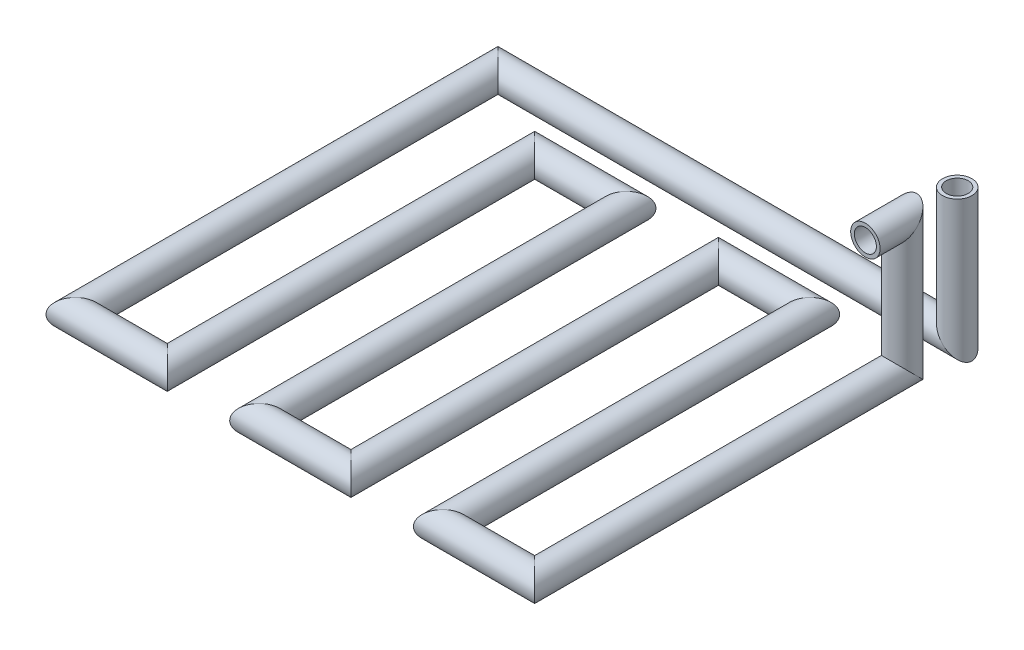
ISO-10303-21;
HEADER;
FILE_DESCRIPTION(('STEP AP214'),'2;1');
FILE_NAME('part.step','',(''),(''),'','','');
FILE_SCHEMA(('AUTOMOTIVE_DESIGN { 1 0 10303 214 1 1 1 1 }'));
ENDSEC;
DATA;
#1=APPLICATION_CONTEXT('core data for automotive mechanical design processes');
#2=APPLICATION_PROTOCOL_DEFINITION('international standard','automotive_design',2000,#1);
#3=PRODUCT_CONTEXT('',#1,'mechanical');
#4=PRODUCT('Part','Part','',(#3));
#5=PRODUCT_RELATED_PRODUCT_CATEGORY('part','',(#4));
#6=PRODUCT_DEFINITION_FORMATION('','',#4);
#7=PRODUCT_DEFINITION_CONTEXT('part definition',#1,'design');
#8=PRODUCT_DEFINITION('design','',#6,#7);
#9=PRODUCT_DEFINITION_SHAPE('','',#8);
#10=(LENGTH_UNIT() NAMED_UNIT(*) SI_UNIT(.MILLI.,.METRE.));
#11=(NAMED_UNIT(*) PLANE_ANGLE_UNIT() SI_UNIT($,.RADIAN.));
#12=(NAMED_UNIT(*) SI_UNIT($,.STERADIAN.) SOLID_ANGLE_UNIT());
#13=UNCERTAINTY_MEASURE_WITH_UNIT(LENGTH_MEASURE(1.E-05),#10,'distance_accuracy_value','');
#14=(GEOMETRIC_REPRESENTATION_CONTEXT(3) GLOBAL_UNCERTAINTY_ASSIGNED_CONTEXT((#13)) GLOBAL_UNIT_ASSIGNED_CONTEXT((#10,
#11,#12)) REPRESENTATION_CONTEXT('',''));
#15=CARTESIAN_POINT('',(0.,0.,0.));
#16=DIRECTION('',(0.,0.,1.));
#17=DIRECTION('',(1.,0.,0.));
#18=AXIS2_PLACEMENT_3D('',#15,#16,#17);
#19=CARTESIAN_POINT('',(0.,0.,-24.9999999999999));
#20=DIRECTION('',(0.,-1.,0.));
#21=DIRECTION('',(0.,0.,-1.));
#22=AXIS2_PLACEMENT_3D('',#19,#20,#21);
#23=PLANE('',#22);
#24=CARTESIAN_POINT('',(0.,0.,-24.9999999999999));
#25=DIRECTION('',(0.,-1.,0.));
#26=DIRECTION('',(0.,0.,-1.));
#27=AXIS2_PLACEMENT_3D('',#24,#25,#26);
#28=CIRCLE('',#27,3.);
#29=CARTESIAN_POINT('',(0.,0.,-27.9999999999999));
#30=VERTEX_POINT('',#29);
#31=EDGE_CURVE('E101',#30,#30,#28,.T.);
#32=ORIENTED_EDGE('',*,*,#31,.T.);
#33=EDGE_LOOP('',(#32));
#34=FACE_BOUND('',#33,.T.);
#35=CARTESIAN_POINT('',(0.,0.,-24.9999999999999));
#36=DIRECTION('',(0.,-1.,0.));
#37=DIRECTION('',(0.,0.,-1.));
#38=AXIS2_PLACEMENT_3D('',#35,#36,#37);
#39=CIRCLE('',#38,4.);
#40=CARTESIAN_POINT('',(0.,0.,-28.9999999999999));
#41=VERTEX_POINT('',#40);
#42=EDGE_CURVE('E45',#41,#41,#39,.T.);
#43=ORIENTED_EDGE('',*,*,#42,.F.);
#44=EDGE_LOOP('',(#43));
#45=FACE_BOUND('',#44,.T.);
#46=ADVANCED_FACE('F30',(#34,#45),#23,.F.);
#47=CARTESIAN_POINT('',(0.,0.,0.));
#48=DIRECTION('',(0.,0.,1.));
#49=DIRECTION('',(1.,0.,0.));
#50=AXIS2_PLACEMENT_3D('',#47,#48,#49);
#51=PLANE('',#50);
#52=CARTESIAN_POINT('',(0.,0.,0.));
#53=DIRECTION('',(0.,0.,1.));
#54=DIRECTION('',(1.,0.,0.));
#55=AXIS2_PLACEMENT_3D('',#52,#53,#54);
#56=CIRCLE('',#55,3.);
#57=CARTESIAN_POINT('',(3.,0.,0.));
#58=VERTEX_POINT('',#57);
#59=EDGE_CURVE('E55',#58,#58,#56,.T.);
#60=ORIENTED_EDGE('',*,*,#59,.F.);
#61=EDGE_LOOP('',(#60));
#62=FACE_BOUND('',#61,.T.);
#63=CARTESIAN_POINT('',(0.,0.,0.));
#64=DIRECTION('',(0.,0.,1.));
#65=DIRECTION('',(1.,0.,0.));
#66=AXIS2_PLACEMENT_3D('',#63,#64,#65);
#67=CIRCLE('',#66,4.);
#68=CARTESIAN_POINT('',(4.,0.,0.));
#69=VERTEX_POINT('',#68);
#70=EDGE_CURVE('E34',#69,#69,#67,.T.);
#71=ORIENTED_EDGE('',*,*,#70,.T.);
#72=EDGE_LOOP('',(#71));
#73=FACE_BOUND('',#72,.T.);
#74=ADVANCED_FACE('F198',(#62,#73),#51,.T.);
#75=CARTESIAN_POINT('',(0.,-41.7,-24.9999999999999));
#76=DIRECTION('',(0.,1.,0.));
#77=DIRECTION('',(0.,0.,1.));
#78=AXIS2_PLACEMENT_3D('',#75,#76,#77);
#79=CYLINDRICAL_SURFACE('',#78,4.);
#80=CARTESIAN_POINT('',(0.,-35.,-24.9999999999999));
#81=DIRECTION('',(0.707106781186547,0.707106781186547,0.));
#82=DIRECTION('',(0.707106781186547,-0.707106781186547,0.));
#83=AXIS2_PLACEMENT_3D('',#80,#81,#82);
#84=ELLIPSE('',#83,5.65685424949238,4.);
#85=CARTESIAN_POINT('',(3.99999999999997,-39.,-24.9999999999999));
#86=VERTEX_POINT('',#85);
#87=EDGE_CURVE('E47',#86,#86,#84,.T.);
#88=ORIENTED_EDGE('',*,*,#87,.T.);
#89=EDGE_LOOP('',(#88));
#90=FACE_BOUND('',#89,.T.);
#91=ORIENTED_EDGE('',*,*,#42,.T.);
#92=EDGE_LOOP('',(#91));
#93=FACE_BOUND('',#92,.T.);
#94=ADVANCED_FACE('F194',(#90,#93),#79,.T.);
#95=CARTESIAN_POINT('',(-128.4,-35.,-24.9999999999999));
#96=DIRECTION('',(1.,0.,0.));
#97=DIRECTION('',(0.,1.,0.));
#98=AXIS2_PLACEMENT_3D('',#95,#96,#97);
#99=CYLINDRICAL_SURFACE('',#98,4.);
#100=CARTESIAN_POINT('',(-125.,-35.,-24.9999999999999));
#101=DIRECTION('',(0.707106781186547,0.,-0.707106781186547));
#102=DIRECTION('',(-0.707106781186547,0.,-0.707106781186547));
#103=AXIS2_PLACEMENT_3D('',#100,#101,#102);
#104=ELLIPSE('',#103,5.65685424949238,4.);
#105=CARTESIAN_POINT('',(-129.,-35.,-28.9999999999999));
#106=VERTEX_POINT('',#105);
#107=EDGE_CURVE('E52',#106,#106,#104,.T.);
#108=ORIENTED_EDGE('',*,*,#107,.T.);
#109=EDGE_LOOP('',(#108));
#110=FACE_BOUND('',#109,.T.);
#111=ORIENTED_EDGE('',*,*,#87,.F.);
#112=EDGE_LOOP('',(#111));
#113=FACE_BOUND('',#112,.T.);
#114=ADVANCED_FACE('F190',(#110,#113),#99,.T.);
#115=CARTESIAN_POINT('',(-125.,-35.,93.4));
#116=DIRECTION('',(0.,0.,-1.));
#117=DIRECTION('',(0.,1.,0.));
#118=AXIS2_PLACEMENT_3D('',#115,#116,#117);
#119=CYLINDRICAL_SURFACE('',#118,4.);
#120=CARTESIAN_POINT('',(-125.,-35.,90.));
#121=DIRECTION('',(-0.707106781186548,0.,-0.707106781186547));
#122=DIRECTION('',(-0.707106781186548,0.,0.707106781186547));
#123=AXIS2_PLACEMENT_3D('',#120,#121,#122);
#124=ELLIPSE('',#123,5.65685424949238,4.);
#125=CARTESIAN_POINT('',(-129.,-35.,94.));
#126=VERTEX_POINT('',#125);
#127=EDGE_CURVE('E106',#126,#126,#124,.T.);
#128=ORIENTED_EDGE('',*,*,#127,.T.);
#129=EDGE_LOOP('',(#128));
#130=FACE_BOUND('',#129,.T.);
#131=ORIENTED_EDGE('',*,*,#107,.F.);
#132=EDGE_LOOP('',(#131));
#133=FACE_BOUND('',#132,.T.);
#134=ADVANCED_FACE('F186',(#130,#133),#119,.T.);
#135=CARTESIAN_POINT('',(-96.6000000000001,-35.,90.));
#136=DIRECTION('',(-1.,0.,0.));
#137=DIRECTION('',(0.,-1.,0.));
#138=AXIS2_PLACEMENT_3D('',#135,#136,#137);
#139=CYLINDRICAL_SURFACE('',#138,4.);
#140=CARTESIAN_POINT('',(-100.,-35.,90.));
#141=DIRECTION('',(-0.707106781186547,0.,0.707106781186547));
#142=DIRECTION('',(0.707106781186547,0.,0.707106781186547));
#143=AXIS2_PLACEMENT_3D('',#140,#141,#142);
#144=ELLIPSE('',#143,5.65685424949238,4.);
#145=CARTESIAN_POINT('',(-96.,-35.,94.));
#146=VERTEX_POINT('',#145);
#147=EDGE_CURVE('E109',#146,#146,#144,.T.);
#148=ORIENTED_EDGE('',*,*,#147,.T.);
#149=EDGE_LOOP('',(#148));
#150=FACE_BOUND('',#149,.T.);
#151=ORIENTED_EDGE('',*,*,#127,.F.);
#152=EDGE_LOOP('',(#151));
#153=FACE_BOUND('',#152,.T.);
#154=ADVANCED_FACE('F182',(#150,#153),#139,.T.);
#155=CARTESIAN_POINT('',(-100.,-35.,-13.4000000000001));
#156=DIRECTION('',(0.,0.,1.));
#157=DIRECTION('',(0.,-1.,0.));
#158=AXIS2_PLACEMENT_3D('',#155,#156,#157);
#159=CYLINDRICAL_SURFACE('',#158,4.);
#160=CARTESIAN_POINT('',(-100.,-35.,-10.));
#161=DIRECTION('',(-0.707106781186547,0.,0.707106781186548));
#162=DIRECTION('',(-0.707106781186548,0.,-0.707106781186547));
#163=AXIS2_PLACEMENT_3D('',#160,#161,#162);
#164=ELLIPSE('',#163,5.65685424949238,4.);
#165=CARTESIAN_POINT('',(-104.,-35.,-14.));
#166=VERTEX_POINT('',#165);
#167=EDGE_CURVE('E112',#166,#166,#164,.T.);
#168=ORIENTED_EDGE('',*,*,#167,.T.);
#169=EDGE_LOOP('',(#168));
#170=FACE_BOUND('',#169,.T.);
#171=ORIENTED_EDGE('',*,*,#147,.F.);
#172=EDGE_LOOP('',(#171));
#173=FACE_BOUND('',#172,.T.);
#174=ADVANCED_FACE('F178',(#170,#173),#159,.T.);
#175=CARTESIAN_POINT('',(-71.6,-35.,-10.));
#176=DIRECTION('',(-1.,0.,0.));
#177=DIRECTION('',(0.,-1.,0.));
#178=AXIS2_PLACEMENT_3D('',#175,#176,#177);
#179=CYLINDRICAL_SURFACE('',#178,4.);
#180=CARTESIAN_POINT('',(-75.,-35.,-10.));
#181=DIRECTION('',(-0.707106781186548,0.,-0.707106781186547));
#182=DIRECTION('',(0.707106781186547,0.,-0.707106781186548));
#183=AXIS2_PLACEMENT_3D('',#180,#181,#182);
#184=ELLIPSE('',#183,5.65685424949238,4.);
#185=CARTESIAN_POINT('',(-71.,-35.,-14.));
#186=VERTEX_POINT('',#185);
#187=EDGE_CURVE('E115',#186,#186,#184,.T.);
#188=ORIENTED_EDGE('',*,*,#187,.T.);
#189=EDGE_LOOP('',(#188));
#190=FACE_BOUND('',#189,.T.);
#191=ORIENTED_EDGE('',*,*,#167,.F.);
#192=EDGE_LOOP('',(#191));
#193=FACE_BOUND('',#192,.T.);
#194=ADVANCED_FACE('F174',(#190,#193),#179,.T.);
#195=CARTESIAN_POINT('',(-75.,-35.,93.4));
#196=DIRECTION('',(0.,0.,-1.));
#197=DIRECTION('',(0.,1.,0.));
#198=AXIS2_PLACEMENT_3D('',#195,#196,#197);
#199=CYLINDRICAL_SURFACE('',#198,4.);
#200=CARTESIAN_POINT('',(-75.,-35.,90.));
#201=DIRECTION('',(-0.707106781186547,0.,-0.707106781186547));
#202=DIRECTION('',(-0.707106781186547,0.,0.707106781186547));
#203=AXIS2_PLACEMENT_3D('',#200,#201,#202);
#204=ELLIPSE('',#203,5.65685424949238,4.);
#205=CARTESIAN_POINT('',(-79.,-35.,94.));
#206=VERTEX_POINT('',#205);
#207=EDGE_CURVE('E118',#206,#206,#204,.T.);
#208=ORIENTED_EDGE('',*,*,#207,.T.);
#209=EDGE_LOOP('',(#208));
#210=FACE_BOUND('',#209,.T.);
#211=ORIENTED_EDGE('',*,*,#187,.F.);
#212=EDGE_LOOP('',(#211));
#213=FACE_BOUND('',#212,.T.);
#214=ADVANCED_FACE('F170',(#210,#213),#199,.T.);
#215=CARTESIAN_POINT('',(-46.6,-35.,90.));
#216=DIRECTION('',(-1.,0.,0.));
#217=DIRECTION('',(0.,-1.,0.));
#218=AXIS2_PLACEMENT_3D('',#215,#216,#217);
#219=CYLINDRICAL_SURFACE('',#218,4.);
#220=CARTESIAN_POINT('',(-50.,-35.,90.));
#221=DIRECTION('',(-0.707106781186548,0.,0.707106781186547));
#222=DIRECTION('',(0.707106781186548,0.,0.707106781186547));
#223=AXIS2_PLACEMENT_3D('',#220,#221,#222);
#224=ELLIPSE('',#223,5.65685424949238,4.);
#225=CARTESIAN_POINT('',(-46.,-35.,94.));
#226=VERTEX_POINT('',#225);
#227=EDGE_CURVE('E121',#226,#226,#224,.T.);
#228=ORIENTED_EDGE('',*,*,#227,.T.);
#229=EDGE_LOOP('',(#228));
#230=FACE_BOUND('',#229,.T.);
#231=ORIENTED_EDGE('',*,*,#207,.F.);
#232=EDGE_LOOP('',(#231));
#233=FACE_BOUND('',#232,.T.);
#234=ADVANCED_FACE('F166',(#230,#233),#219,.T.);
#235=CARTESIAN_POINT('',(-50.,-35.,-13.4));
#236=DIRECTION('',(0.,0.,1.));
#237=DIRECTION('',(0.,-1.,0.));
#238=AXIS2_PLACEMENT_3D('',#235,#236,#237);
#239=CYLINDRICAL_SURFACE('',#238,4.);
#240=CARTESIAN_POINT('',(-50.,-35.,-10.));
#241=DIRECTION('',(-0.707106781186548,0.,0.707106781186547));
#242=DIRECTION('',(-0.707106781186548,0.,-0.707106781186547));
#243=AXIS2_PLACEMENT_3D('',#240,#241,#242);
#244=ELLIPSE('',#243,5.65685424949238,4.);
#245=CARTESIAN_POINT('',(-54.,-35.,-14.));
#246=VERTEX_POINT('',#245);
#247=EDGE_CURVE('E124',#246,#246,#244,.T.);
#248=ORIENTED_EDGE('',*,*,#247,.T.);
#249=EDGE_LOOP('',(#248));
#250=FACE_BOUND('',#249,.T.);
#251=ORIENTED_EDGE('',*,*,#227,.F.);
#252=EDGE_LOOP('',(#251));
#253=FACE_BOUND('',#252,.T.);
#254=ADVANCED_FACE('F162',(#250,#253),#239,.T.);
#255=CARTESIAN_POINT('',(-21.6,-35.,-10.));
#256=DIRECTION('',(-1.,0.,0.));
#257=DIRECTION('',(0.,-1.,0.));
#258=AXIS2_PLACEMENT_3D('',#255,#256,#257);
#259=CYLINDRICAL_SURFACE('',#258,4.);
#260=CARTESIAN_POINT('',(-25.,-35.,-10.));
#261=DIRECTION('',(-0.707106781186547,0.,-0.707106781186547));
#262=DIRECTION('',(0.707106781186547,0.,-0.707106781186547));
#263=AXIS2_PLACEMENT_3D('',#260,#261,#262);
#264=ELLIPSE('',#263,5.65685424949238,4.);
#265=CARTESIAN_POINT('',(-21.,-35.,-14.));
#266=VERTEX_POINT('',#265);
#267=EDGE_CURVE('E127',#266,#266,#264,.T.);
#268=ORIENTED_EDGE('',*,*,#267,.T.);
#269=EDGE_LOOP('',(#268));
#270=FACE_BOUND('',#269,.T.);
#271=ORIENTED_EDGE('',*,*,#247,.F.);
#272=EDGE_LOOP('',(#271));
#273=FACE_BOUND('',#272,.T.);
#274=ADVANCED_FACE('F158',(#270,#273),#259,.T.);
#275=CARTESIAN_POINT('',(-25.,-35.,93.4));
#276=DIRECTION('',(0.,0.,-1.));
#277=DIRECTION('',(0.,1.,0.));
#278=AXIS2_PLACEMENT_3D('',#275,#276,#277);
#279=CYLINDRICAL_SURFACE('',#278,4.);
#280=CARTESIAN_POINT('',(-25.,-35.,90.));
#281=DIRECTION('',(-0.707106781186547,0.,-0.707106781186548));
#282=DIRECTION('',(-0.707106781186547,0.,0.707106781186548));
#283=AXIS2_PLACEMENT_3D('',#280,#281,#282);
#284=ELLIPSE('',#283,5.65685424949238,4.);
#285=CARTESIAN_POINT('',(-29.,-35.,94.));
#286=VERTEX_POINT('',#285);
#287=EDGE_CURVE('E130',#286,#286,#284,.T.);
#288=ORIENTED_EDGE('',*,*,#287,.T.);
#289=EDGE_LOOP('',(#288));
#290=FACE_BOUND('',#289,.T.);
#291=ORIENTED_EDGE('',*,*,#267,.F.);
#292=EDGE_LOOP('',(#291));
#293=FACE_BOUND('',#292,.T.);
#294=ADVANCED_FACE('F155',(#290,#293),#279,.T.);
#295=CARTESIAN_POINT('',(3.39999999999999,-35.,90.));
#296=DIRECTION('',(-1.,0.,0.));
#297=DIRECTION('',(0.,0.,1.));
#298=AXIS2_PLACEMENT_3D('',#295,#296,#297);
#299=CYLINDRICAL_SURFACE('',#298,4.);
#300=CARTESIAN_POINT('',(0.,-35.,90.));
#301=DIRECTION('',(-0.707106781186547,0.,0.707106781186548));
#302=DIRECTION('',(0.707106781186547,0.,0.707106781186548));
#303=AXIS2_PLACEMENT_3D('',#300,#301,#302);
#304=ELLIPSE('',#303,5.65685424949238,4.);
#305=CARTESIAN_POINT('',(4.,-35.,94.));
#306=VERTEX_POINT('',#305);
#307=EDGE_CURVE('E132',#306,#306,#304,.T.);
#308=ORIENTED_EDGE('',*,*,#307,.T.);
#309=EDGE_LOOP('',(#308));
#310=FACE_BOUND('',#309,.T.);
#311=ORIENTED_EDGE('',*,*,#287,.F.);
#312=EDGE_LOOP('',(#311));
#313=FACE_BOUND('',#312,.T.);
#314=ADVANCED_FACE('F150',(#310,#313),#299,.T.);
#315=CARTESIAN_POINT('',(0.,-35.,-16.7));
#316=DIRECTION('',(0.,0.,1.));
#317=DIRECTION('',(1.,0.,0.));
#318=AXIS2_PLACEMENT_3D('',#315,#316,#317);
#319=CYLINDRICAL_SURFACE('',#318,4.);
#320=CARTESIAN_POINT('',(0.,-35.,-10.));
#321=DIRECTION('',(0.,-0.707106781186547,0.707106781186547));
#322=DIRECTION('',(0.,-0.707106781186547,-0.707106781186547));
#323=AXIS2_PLACEMENT_3D('',#320,#321,#322);
#324=ELLIPSE('',#323,5.65685424949238,4.);
#325=CARTESIAN_POINT('',(0.,-39.,-14.));
#326=VERTEX_POINT('',#325);
#327=EDGE_CURVE('E42',#326,#326,#324,.T.);
#328=ORIENTED_EDGE('',*,*,#327,.T.);
#329=EDGE_LOOP('',(#328));
#330=FACE_BOUND('',#329,.T.);
#331=ORIENTED_EDGE('',*,*,#307,.F.);
#332=EDGE_LOOP('',(#331));
#333=FACE_BOUND('',#332,.T.);
#334=ADVANCED_FACE('F139',(#330,#333),#319,.T.);
#335=CARTESIAN_POINT('',(0.,6.7,-10.));
#336=DIRECTION('',(0.,-1.,0.));
#337=DIRECTION('',(0.,0.,-1.));
#338=AXIS2_PLACEMENT_3D('',#335,#336,#337);
#339=CYLINDRICAL_SURFACE('',#338,4.);
#340=CARTESIAN_POINT('',(0.,0.,-10.));
#341=DIRECTION('',(0.,-0.707106781186547,-0.707106781186547));
#342=DIRECTION('',(0.,0.707106781186547,-0.707106781186547));
#343=AXIS2_PLACEMENT_3D('',#340,#341,#342);
#344=ELLIPSE('',#343,5.65685424949238,4.);
#345=CARTESIAN_POINT('',(0.,4.,-14.));
#346=VERTEX_POINT('',#345);
#347=EDGE_CURVE('E10',#346,#346,#344,.T.);
#348=ORIENTED_EDGE('',*,*,#347,.T.);
#349=EDGE_LOOP('',(#348));
#350=FACE_BOUND('',#349,.T.);
#351=ORIENTED_EDGE('',*,*,#327,.F.);
#352=EDGE_LOOP('',(#351));
#353=FACE_BOUND('',#352,.T.);
#354=ADVANCED_FACE('F142',(#350,#353),#339,.T.);
#355=CARTESIAN_POINT('',(0.,0.,0.));
#356=DIRECTION('',(0.,0.,-1.));
#357=DIRECTION('',(-1.,0.,0.));
#358=AXIS2_PLACEMENT_3D('',#355,#356,#357);
#359=CYLINDRICAL_SURFACE('',#358,4.);
#360=ORIENTED_EDGE('',*,*,#70,.F.);
#361=EDGE_LOOP('',(#360));
#362=FACE_BOUND('',#361,.T.);
#363=ORIENTED_EDGE('',*,*,#347,.F.);
#364=EDGE_LOOP('',(#363));
#365=FACE_BOUND('',#364,.T.);
#366=ADVANCED_FACE('F32',(#362,#365),#359,.T.);
#367=CARTESIAN_POINT('',(0.,-41.7,-24.9999999999999));
#368=DIRECTION('',(0.,1.,0.));
#369=DIRECTION('',(0.,0.,1.));
#370=AXIS2_PLACEMENT_3D('',#367,#368,#369);
#371=CYLINDRICAL_SURFACE('',#370,3.);
#372=CARTESIAN_POINT('',(0.,-35.,-24.9999999999999));
#373=DIRECTION('',(0.707106781186547,0.707106781186547,0.));
#374=DIRECTION('',(0.707106781186548,-0.707106781186548,0.));
#375=AXIS2_PLACEMENT_3D('',#372,#373,#374);
#376=ELLIPSE('',#375,4.24264068711929,3.);
#377=CARTESIAN_POINT('',(2.99999999999995,-38.,-24.9999999999999));
#378=VERTEX_POINT('',#377);
#379=EDGE_CURVE('E98',#378,#378,#376,.T.);
#380=ORIENTED_EDGE('',*,*,#379,.F.);
#381=EDGE_LOOP('',(#380));
#382=FACE_BOUND('',#381,.T.);
#383=ORIENTED_EDGE('',*,*,#31,.F.);
#384=EDGE_LOOP('',(#383));
#385=FACE_BOUND('',#384,.T.);
#386=ADVANCED_FACE('F148',(#382,#385),#371,.F.);
#387=CARTESIAN_POINT('',(-128.4,-35.,-24.9999999999999));
#388=DIRECTION('',(1.,0.,0.));
#389=DIRECTION('',(0.,1.,0.));
#390=AXIS2_PLACEMENT_3D('',#387,#388,#389);
#391=CYLINDRICAL_SURFACE('',#390,3.);
#392=CARTESIAN_POINT('',(-125.,-35.,-24.9999999999999));
#393=DIRECTION('',(0.707106781186548,0.,-0.707106781186548));
#394=DIRECTION('',(-0.707106781186548,0.,-0.707106781186548));
#395=AXIS2_PLACEMENT_3D('',#392,#393,#394);
#396=ELLIPSE('',#395,4.24264068711929,3.);
#397=CARTESIAN_POINT('',(-128.,-35.,-27.9999999999999));
#398=VERTEX_POINT('',#397);
#399=EDGE_CURVE('E95',#398,#398,#396,.T.);
#400=ORIENTED_EDGE('',*,*,#399,.F.);
#401=EDGE_LOOP('',(#400));
#402=FACE_BOUND('',#401,.T.);
#403=ORIENTED_EDGE('',*,*,#379,.T.);
#404=EDGE_LOOP('',(#403));
#405=FACE_BOUND('',#404,.T.);
#406=ADVANCED_FACE('F209',(#402,#405),#391,.F.);
#407=CARTESIAN_POINT('',(-125.,-35.,93.4));
#408=DIRECTION('',(0.,0.,-1.));
#409=DIRECTION('',(0.,1.,0.));
#410=AXIS2_PLACEMENT_3D('',#407,#408,#409);
#411=CYLINDRICAL_SURFACE('',#410,3.);
#412=CARTESIAN_POINT('',(-125.,-35.,90.));
#413=DIRECTION('',(-0.707106781186548,0.,-0.707106781186548));
#414=DIRECTION('',(-0.707106781186548,0.,0.707106781186548));
#415=AXIS2_PLACEMENT_3D('',#412,#413,#414);
#416=ELLIPSE('',#415,4.24264068711929,3.);
#417=CARTESIAN_POINT('',(-128.,-35.,93.));
#418=VERTEX_POINT('',#417);
#419=EDGE_CURVE('E92',#418,#418,#416,.T.);
#420=ORIENTED_EDGE('',*,*,#419,.F.);
#421=EDGE_LOOP('',(#420));
#422=FACE_BOUND('',#421,.T.);
#423=ORIENTED_EDGE('',*,*,#399,.T.);
#424=EDGE_LOOP('',(#423));
#425=FACE_BOUND('',#424,.T.);
#426=ADVANCED_FACE('F213',(#422,#425),#411,.F.);
#427=CARTESIAN_POINT('',(-96.6000000000001,-35.,90.));
#428=DIRECTION('',(-1.,0.,0.));
#429=DIRECTION('',(0.,-1.,0.));
#430=AXIS2_PLACEMENT_3D('',#427,#428,#429);
#431=CYLINDRICAL_SURFACE('',#430,3.);
#432=CARTESIAN_POINT('',(-100.,-35.,90.));
#433=DIRECTION('',(-0.707106781186547,0.,0.707106781186547));
#434=DIRECTION('',(0.707106781186548,0.,0.707106781186548));
#435=AXIS2_PLACEMENT_3D('',#432,#433,#434);
#436=ELLIPSE('',#435,4.24264068711929,3.);
#437=CARTESIAN_POINT('',(-97.,-35.,93.));
#438=VERTEX_POINT('',#437);
#439=EDGE_CURVE('E89',#438,#438,#436,.T.);
#440=ORIENTED_EDGE('',*,*,#439,.F.);
#441=EDGE_LOOP('',(#440));
#442=FACE_BOUND('',#441,.T.);
#443=ORIENTED_EDGE('',*,*,#419,.T.);
#444=EDGE_LOOP('',(#443));
#445=FACE_BOUND('',#444,.T.);
#446=ADVANCED_FACE('F217',(#442,#445),#431,.F.);
#447=CARTESIAN_POINT('',(-100.,-35.,-13.4000000000001));
#448=DIRECTION('',(0.,0.,1.));
#449=DIRECTION('',(0.,-1.,0.));
#450=AXIS2_PLACEMENT_3D('',#447,#448,#449);
#451=CYLINDRICAL_SURFACE('',#450,3.);
#452=CARTESIAN_POINT('',(-100.,-35.,-10.));
#453=DIRECTION('',(-0.707106781186547,0.,0.707106781186548));
#454=DIRECTION('',(-0.707106781186548,0.,-0.707106781186547));
#455=AXIS2_PLACEMENT_3D('',#452,#453,#454);
#456=ELLIPSE('',#455,4.24264068711929,3.);
#457=CARTESIAN_POINT('',(-103.,-35.,-13.));
#458=VERTEX_POINT('',#457);
#459=EDGE_CURVE('E86',#458,#458,#456,.T.);
#460=ORIENTED_EDGE('',*,*,#459,.F.);
#461=EDGE_LOOP('',(#460));
#462=FACE_BOUND('',#461,.T.);
#463=ORIENTED_EDGE('',*,*,#439,.T.);
#464=EDGE_LOOP('',(#463));
#465=FACE_BOUND('',#464,.T.);
#466=ADVANCED_FACE('F221',(#462,#465),#451,.F.);
#467=CARTESIAN_POINT('',(-71.6,-35.,-10.));
#468=DIRECTION('',(-1.,0.,0.));
#469=DIRECTION('',(0.,-1.,0.));
#470=AXIS2_PLACEMENT_3D('',#467,#468,#469);
#471=CYLINDRICAL_SURFACE('',#470,3.);
#472=CARTESIAN_POINT('',(-75.,-35.,-10.));
#473=DIRECTION('',(-0.707106781186548,0.,-0.707106781186548));
#474=DIRECTION('',(0.707106781186547,0.,-0.707106781186548));
#475=AXIS2_PLACEMENT_3D('',#472,#473,#474);
#476=ELLIPSE('',#475,4.24264068711929,3.);
#477=CARTESIAN_POINT('',(-72.,-35.,-13.));
#478=VERTEX_POINT('',#477);
#479=EDGE_CURVE('E83',#478,#478,#476,.T.);
#480=ORIENTED_EDGE('',*,*,#479,.F.);
#481=EDGE_LOOP('',(#480));
#482=FACE_BOUND('',#481,.T.);
#483=ORIENTED_EDGE('',*,*,#459,.T.);
#484=EDGE_LOOP('',(#483));
#485=FACE_BOUND('',#484,.T.);
#486=ADVANCED_FACE('F225',(#482,#485),#471,.F.);
#487=CARTESIAN_POINT('',(-75.,-35.,93.4));
#488=DIRECTION('',(0.,0.,-1.));
#489=DIRECTION('',(0.,1.,0.));
#490=AXIS2_PLACEMENT_3D('',#487,#488,#489);
#491=CYLINDRICAL_SURFACE('',#490,3.);
#492=CARTESIAN_POINT('',(-75.,-35.,90.));
#493=DIRECTION('',(-0.707106781186548,0.,-0.707106781186548));
#494=DIRECTION('',(-0.707106781186548,0.,0.707106781186548));
#495=AXIS2_PLACEMENT_3D('',#492,#493,#494);
#496=ELLIPSE('',#495,4.24264068711929,3.);
#497=CARTESIAN_POINT('',(-78.,-35.,93.));
#498=VERTEX_POINT('',#497);
#499=EDGE_CURVE('E80',#498,#498,#496,.T.);
#500=ORIENTED_EDGE('',*,*,#499,.F.);
#501=EDGE_LOOP('',(#500));
#502=FACE_BOUND('',#501,.T.);
#503=ORIENTED_EDGE('',*,*,#479,.T.);
#504=EDGE_LOOP('',(#503));
#505=FACE_BOUND('',#504,.T.);
#506=ADVANCED_FACE('F229',(#502,#505),#491,.F.);
#507=CARTESIAN_POINT('',(-46.6,-35.,90.));
#508=DIRECTION('',(-1.,0.,0.));
#509=DIRECTION('',(0.,-1.,0.));
#510=AXIS2_PLACEMENT_3D('',#507,#508,#509);
#511=CYLINDRICAL_SURFACE('',#510,3.);
#512=CARTESIAN_POINT('',(-50.,-35.,90.));
#513=DIRECTION('',(-0.707106781186548,0.,0.707106781186548));
#514=DIRECTION('',(0.707106781186548,0.,0.707106781186548));
#515=AXIS2_PLACEMENT_3D('',#512,#513,#514);
#516=ELLIPSE('',#515,4.24264068711929,3.);
#517=CARTESIAN_POINT('',(-47.,-35.,93.));
#518=VERTEX_POINT('',#517);
#519=EDGE_CURVE('E77',#518,#518,#516,.T.);
#520=ORIENTED_EDGE('',*,*,#519,.F.);
#521=EDGE_LOOP('',(#520));
#522=FACE_BOUND('',#521,.T.);
#523=ORIENTED_EDGE('',*,*,#499,.T.);
#524=EDGE_LOOP('',(#523));
#525=FACE_BOUND('',#524,.T.);
#526=ADVANCED_FACE('F233',(#522,#525),#511,.F.);
#527=CARTESIAN_POINT('',(-50.,-35.,-13.4));
#528=DIRECTION('',(0.,0.,1.));
#529=DIRECTION('',(0.,-1.,0.));
#530=AXIS2_PLACEMENT_3D('',#527,#528,#529);
#531=CYLINDRICAL_SURFACE('',#530,3.);
#532=CARTESIAN_POINT('',(-50.,-35.,-10.));
#533=DIRECTION('',(-0.707106781186548,0.,0.707106781186548));
#534=DIRECTION('',(-0.707106781186548,0.,-0.707106781186548));
#535=AXIS2_PLACEMENT_3D('',#532,#533,#534);
#536=ELLIPSE('',#535,4.24264068711929,3.);
#537=CARTESIAN_POINT('',(-53.,-35.,-13.));
#538=VERTEX_POINT('',#537);
#539=EDGE_CURVE('E74',#538,#538,#536,.T.);
#540=ORIENTED_EDGE('',*,*,#539,.F.);
#541=EDGE_LOOP('',(#540));
#542=FACE_BOUND('',#541,.T.);
#543=ORIENTED_EDGE('',*,*,#519,.T.);
#544=EDGE_LOOP('',(#543));
#545=FACE_BOUND('',#544,.T.);
#546=ADVANCED_FACE('F237',(#542,#545),#531,.F.);
#547=CARTESIAN_POINT('',(-21.6,-35.,-10.));
#548=DIRECTION('',(-1.,0.,0.));
#549=DIRECTION('',(0.,-1.,0.));
#550=AXIS2_PLACEMENT_3D('',#547,#548,#549);
#551=CYLINDRICAL_SURFACE('',#550,3.);
#552=CARTESIAN_POINT('',(-25.,-35.,-10.));
#553=DIRECTION('',(-0.707106781186547,0.,-0.707106781186547));
#554=DIRECTION('',(0.707106781186548,0.,-0.707106781186548));
#555=AXIS2_PLACEMENT_3D('',#552,#553,#554);
#556=ELLIPSE('',#555,4.24264068711929,3.);
#557=CARTESIAN_POINT('',(-22.,-35.,-13.));
#558=VERTEX_POINT('',#557);
#559=EDGE_CURVE('E71',#558,#558,#556,.T.);
#560=ORIENTED_EDGE('',*,*,#559,.F.);
#561=EDGE_LOOP('',(#560));
#562=FACE_BOUND('',#561,.T.);
#563=ORIENTED_EDGE('',*,*,#539,.T.);
#564=EDGE_LOOP('',(#563));
#565=FACE_BOUND('',#564,.T.);
#566=ADVANCED_FACE('F241',(#562,#565),#551,.F.);
#567=CARTESIAN_POINT('',(-25.,-35.,93.4));
#568=DIRECTION('',(0.,0.,-1.));
#569=DIRECTION('',(0.,1.,0.));
#570=AXIS2_PLACEMENT_3D('',#567,#568,#569);
#571=CYLINDRICAL_SURFACE('',#570,3.);
#572=CARTESIAN_POINT('',(-25.,-35.,90.));
#573=DIRECTION('',(-0.707106781186548,0.,-0.707106781186548));
#574=DIRECTION('',(-0.707106781186548,0.,0.707106781186548));
#575=AXIS2_PLACEMENT_3D('',#572,#573,#574);
#576=ELLIPSE('',#575,4.24264068711929,3.);
#577=CARTESIAN_POINT('',(-28.,-35.,93.));
#578=VERTEX_POINT('',#577);
#579=EDGE_CURVE('E68',#578,#578,#576,.T.);
#580=ORIENTED_EDGE('',*,*,#579,.F.);
#581=EDGE_LOOP('',(#580));
#582=FACE_BOUND('',#581,.T.);
#583=ORIENTED_EDGE('',*,*,#559,.T.);
#584=EDGE_LOOP('',(#583));
#585=FACE_BOUND('',#584,.T.);
#586=ADVANCED_FACE('F245',(#582,#585),#571,.F.);
#587=CARTESIAN_POINT('',(3.39999999999999,-35.,90.));
#588=DIRECTION('',(-1.,0.,0.));
#589=DIRECTION('',(0.,0.,1.));
#590=AXIS2_PLACEMENT_3D('',#587,#588,#589);
#591=CYLINDRICAL_SURFACE('',#590,3.);
#592=CARTESIAN_POINT('',(0.,-35.,90.));
#593=DIRECTION('',(-0.707106781186548,0.,0.707106781186548));
#594=DIRECTION('',(0.707106781186548,0.,0.707106781186548));
#595=AXIS2_PLACEMENT_3D('',#592,#593,#594);
#596=ELLIPSE('',#595,4.24264068711929,3.);
#597=CARTESIAN_POINT('',(3.,-35.,93.));
#598=VERTEX_POINT('',#597);
#599=EDGE_CURVE('E65',#598,#598,#596,.T.);
#600=ORIENTED_EDGE('',*,*,#599,.F.);
#601=EDGE_LOOP('',(#600));
#602=FACE_BOUND('',#601,.T.);
#603=ORIENTED_EDGE('',*,*,#579,.T.);
#604=EDGE_LOOP('',(#603));
#605=FACE_BOUND('',#604,.T.);
#606=ADVANCED_FACE('F249',(#602,#605),#591,.F.);
#607=CARTESIAN_POINT('',(0.,-35.,-16.7));
#608=DIRECTION('',(0.,0.,1.));
#609=DIRECTION('',(1.,0.,0.));
#610=AXIS2_PLACEMENT_3D('',#607,#608,#609);
#611=CYLINDRICAL_SURFACE('',#610,3.);
#612=CARTESIAN_POINT('',(0.,-35.,-10.));
#613=DIRECTION('',(0.,-0.707106781186548,0.707106781186548));
#614=DIRECTION('',(0.,-0.707106781186548,-0.707106781186548));
#615=AXIS2_PLACEMENT_3D('',#612,#613,#614);
#616=ELLIPSE('',#615,4.24264068711929,3.);
#617=CARTESIAN_POINT('',(0.,-38.,-13.));
#618=VERTEX_POINT('',#617);
#619=EDGE_CURVE('E60',#618,#618,#616,.T.);
#620=ORIENTED_EDGE('',*,*,#619,.F.);
#621=EDGE_LOOP('',(#620));
#622=FACE_BOUND('',#621,.T.);
#623=ORIENTED_EDGE('',*,*,#599,.T.);
#624=EDGE_LOOP('',(#623));
#625=FACE_BOUND('',#624,.T.);
#626=ADVANCED_FACE('F253',(#622,#625),#611,.F.);
#627=CARTESIAN_POINT('',(0.,6.7,-10.));
#628=DIRECTION('',(0.,-1.,0.));
#629=DIRECTION('',(0.,0.,-1.));
#630=AXIS2_PLACEMENT_3D('',#627,#628,#629);
#631=CYLINDRICAL_SURFACE('',#630,3.);
#632=CARTESIAN_POINT('',(0.,0.,-10.));
#633=DIRECTION('',(0.,-0.707106781186548,-0.707106781186548));
#634=DIRECTION('',(0.,0.707106781186548,-0.707106781186548));
#635=AXIS2_PLACEMENT_3D('',#632,#633,#634);
#636=ELLIPSE('',#635,4.24264068711929,3.);
#637=CARTESIAN_POINT('',(0.,3.,-13.));
#638=VERTEX_POINT('',#637);
#639=EDGE_CURVE('E48',#638,#638,#636,.T.);
#640=ORIENTED_EDGE('',*,*,#639,.F.);
#641=EDGE_LOOP('',(#640));
#642=FACE_BOUND('',#641,.T.);
#643=ORIENTED_EDGE('',*,*,#619,.T.);
#644=EDGE_LOOP('',(#643));
#645=FACE_BOUND('',#644,.T.);
#646=ADVANCED_FACE('F257',(#642,#645),#631,.F.);
#647=CARTESIAN_POINT('',(0.,0.,0.));
#648=DIRECTION('',(0.,0.,-1.));
#649=DIRECTION('',(-1.,0.,0.));
#650=AXIS2_PLACEMENT_3D('',#647,#648,#649);
#651=CYLINDRICAL_SURFACE('',#650,3.);
#652=ORIENTED_EDGE('',*,*,#59,.T.);
#653=EDGE_LOOP('',(#652));
#654=FACE_BOUND('',#653,.T.);
#655=ORIENTED_EDGE('',*,*,#639,.T.);
#656=EDGE_LOOP('',(#655));
#657=FACE_BOUND('',#656,.T.);
#658=ADVANCED_FACE('F203',(#654,#657),#651,.F.);
#659=CLOSED_SHELL('',(#46,#74,#94,#114,#134,#154,#174,#194,#214,#234,#254,#274,#294,#314,#334,
#354,#366,#386,#406,#426,#446,#466,#486,#506,#526,#546,#566,#586,#606,#626,#646,#658));
#660=MANIFOLD_SOLID_BREP('B2',#659);
#661=ADVANCED_BREP_SHAPE_REPRESENTATION('',(#18,#660),#14);
#662=SHAPE_DEFINITION_REPRESENTATION(#9,#661);
ENDSEC;
END-ISO-10303-21;
